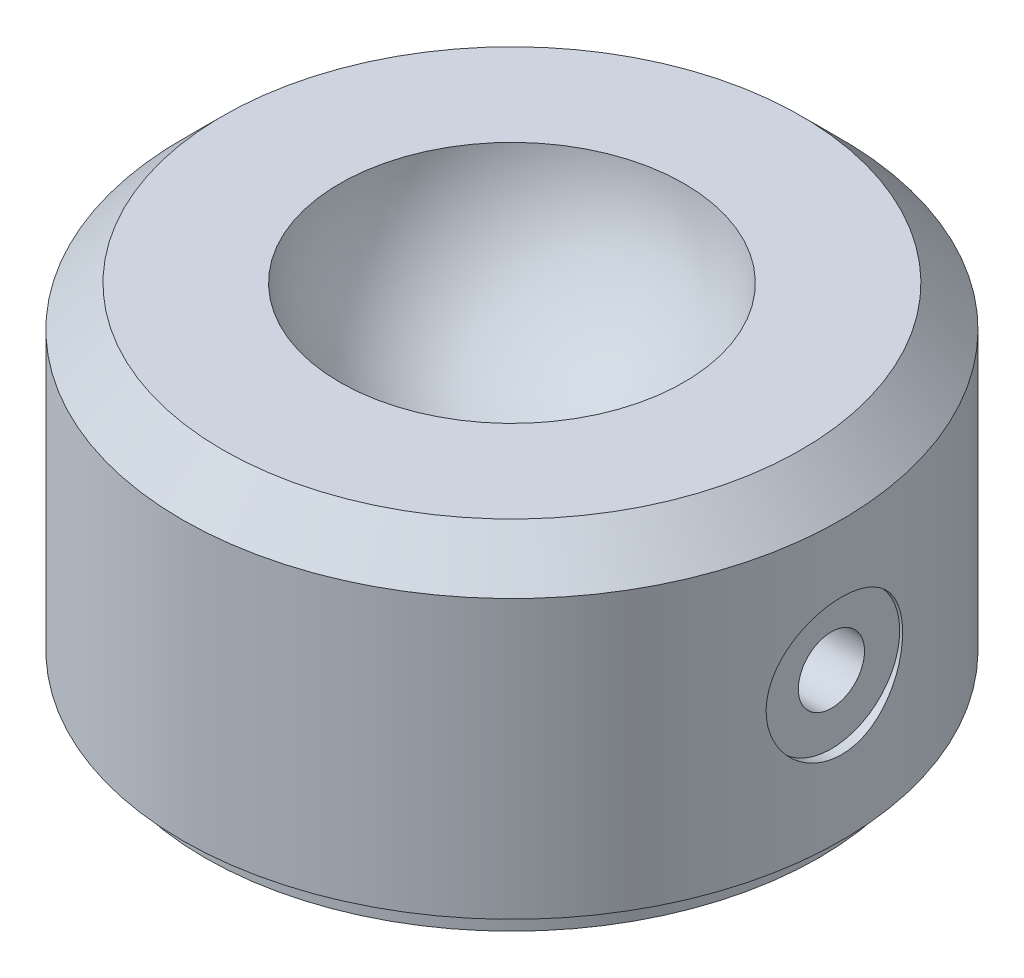
ISO-10303-21;
HEADER;
FILE_DESCRIPTION(('STEP AP214'),'2;1');
FILE_NAME('part.step','',(''),(''),'','','');
FILE_SCHEMA(('AUTOMOTIVE_DESIGN { 1 0 10303 214 1 1 1 1 }'));
ENDSEC;
DATA;
#1=APPLICATION_CONTEXT('core data for automotive mechanical design processes');
#2=APPLICATION_PROTOCOL_DEFINITION('international standard','automotive_design',2000,#1);
#3=PRODUCT_CONTEXT('',#1,'mechanical');
#4=PRODUCT('Part','Part','',(#3));
#5=PRODUCT_RELATED_PRODUCT_CATEGORY('part','',(#4));
#6=PRODUCT_DEFINITION_FORMATION('','',#4);
#7=PRODUCT_DEFINITION_CONTEXT('part definition',#1,'design');
#8=PRODUCT_DEFINITION('design','',#6,#7);
#9=PRODUCT_DEFINITION_SHAPE('','',#8);
#10=(LENGTH_UNIT() NAMED_UNIT(*) SI_UNIT(.MILLI.,.METRE.));
#11=(NAMED_UNIT(*) PLANE_ANGLE_UNIT() SI_UNIT($,.RADIAN.));
#12=(NAMED_UNIT(*) SI_UNIT($,.STERADIAN.) SOLID_ANGLE_UNIT());
#13=UNCERTAINTY_MEASURE_WITH_UNIT(LENGTH_MEASURE(1.E-05),#10,'distance_accuracy_value','');
#14=(GEOMETRIC_REPRESENTATION_CONTEXT(3) GLOBAL_UNCERTAINTY_ASSIGNED_CONTEXT((#13)) GLOBAL_UNIT_ASSIGNED_CONTEXT((#10,
#11,#12)) REPRESENTATION_CONTEXT('',''));
#15=CARTESIAN_POINT('',(0.,0.,0.));
#16=DIRECTION('',(0.,0.,1.));
#17=DIRECTION('',(1.,0.,0.));
#18=AXIS2_PLACEMENT_3D('',#15,#16,#17);
#19=CARTESIAN_POINT('',(0.,6.0071,0.));
#20=DIRECTION('',(0.,1.,0.));
#21=DIRECTION('',(0.,0.,1.));
#22=AXIS2_PLACEMENT_3D('',#19,#20,#21);
#23=PLANE('',#22);
#24=CARTESIAN_POINT('',(0.,6.0071,0.));
#25=DIRECTION('',(0.,1.,0.));
#26=DIRECTION('',(0.,0.,1.));
#27=AXIS2_PLACEMENT_3D('',#24,#25,#26);
#28=CIRCLE('',#27,10.922);
#29=CARTESIAN_POINT('',(0.,6.0071,10.922));
#30=VERTEX_POINT('',#29);
#31=EDGE_CURVE('E80',#30,#30,#28,.T.);
#32=ORIENTED_EDGE('',*,*,#31,.T.);
#33=EDGE_LOOP('',(#32));
#34=FACE_BOUND('',#33,.T.);
#35=CARTESIAN_POINT('',(0.,6.0071,0.));
#36=DIRECTION('',(0.,1.,0.));
#37=DIRECTION('',(0.,0.,1.));
#38=AXIS2_PLACEMENT_3D('',#35,#36,#37);
#39=CIRCLE('',#38,6.5001796436837);
#40=CARTESIAN_POINT('',(0.,6.0071,6.5001796436837));
#41=VERTEX_POINT('',#40);
#42=EDGE_CURVE('E68',#41,#41,#39,.F.);
#43=ORIENTED_EDGE('',*,*,#42,.T.);
#44=EDGE_LOOP('',(#43));
#45=FACE_BOUND('',#44,.T.);
#46=ADVANCED_FACE('F36',(#34,#45),#23,.T.);
#47=CARTESIAN_POINT('',(0.,-6.0071,0.));
#48=DIRECTION('',(0.,1.,0.));
#49=DIRECTION('',(0.,0.,1.));
#50=AXIS2_PLACEMENT_3D('',#47,#48,#49);
#51=PLANE('',#50);
#52=CARTESIAN_POINT('',(0.,-6.0071,0.));
#53=DIRECTION('',(0.,1.,0.));
#54=DIRECTION('',(0.,0.,1.));
#55=AXIS2_PLACEMENT_3D('',#52,#53,#54);
#56=CIRCLE('',#55,12.446);
#57=CARTESIAN_POINT('',(0.,-6.0071,12.446));
#58=VERTEX_POINT('',#57);
#59=EDGE_CURVE('E77',#58,#58,#56,.T.);
#60=ORIENTED_EDGE('',*,*,#59,.F.);
#61=EDGE_LOOP('',(#60));
#62=FACE_BOUND('',#61,.T.);
#63=CARTESIAN_POINT('',(0.,-6.0071,0.));
#64=DIRECTION('',(0.,1.,0.));
#65=DIRECTION('',(0.,0.,1.));
#66=AXIS2_PLACEMENT_3D('',#63,#64,#65);
#67=CIRCLE('',#66,11.5951);
#68=CARTESIAN_POINT('',(0.,-6.0071,11.5951));
#69=VERTEX_POINT('',#68);
#70=EDGE_CURVE('E46',#69,#69,#67,.F.);
#71=ORIENTED_EDGE('',*,*,#70,.F.);
#72=EDGE_LOOP('',(#71));
#73=FACE_BOUND('',#72,.T.);
#74=ADVANCED_FACE('F108',(#62,#73),#51,.F.);
#75=CARTESIAN_POINT('',(0.,6.0071,0.));
#76=DIRECTION('',(0.,-1.,0.));
#77=DIRECTION('',(0.,0.,-1.));
#78=AXIS2_PLACEMENT_3D('',#75,#76,#77);
#79=CYLINDRICAL_SURFACE('',#78,12.446);
#80=CARTESIAN_POINT('',(12.1760550421719,-0.6223,-2.5781));
#81=CARTESIAN_POINT('',(12.1760579161759,-0.765436207380414,-2.57809483831996));
#82=CARTESIAN_POINT('',(12.1786064693682,-0.90863629867503,-2.56613910104311));
#83=CARTESIAN_POINT('',(12.1885089559425,-1.19097753976139,-2.5186765117093));
#84=CARTESIAN_POINT('',(12.195866596214,-1.33011547190427,-2.48315149190922));
#85=CARTESIAN_POINT('',(12.2145190196045,-1.60020702824344,-2.38970579313672));
#86=CARTESIAN_POINT('',(12.2258097359615,-1.73116894205712,-2.33180824041126));
#87=CARTESIAN_POINT('',(12.2510512766012,-1.98151927823464,-2.19532539759628));
#88=CARTESIAN_POINT('',(12.2650019874416,-2.10090819383088,-2.11674098969568));
#89=CARTESIAN_POINT('',(12.2942279247945,-2.32653819900246,-1.93984513553784));
#90=CARTESIAN_POINT('',(12.3095185911322,-2.43257827909951,-1.84127981115731));
#91=CARTESIAN_POINT('',(12.3395659466728,-2.62674359629513,-1.6277683945702));
#92=CARTESIAN_POINT('',(12.3543225969028,-2.71486752802085,-1.51282110980905));
#93=CARTESIAN_POINT('',(12.3818063841349,-2.87148468652724,-1.26847137834301));
#94=CARTESIAN_POINT('',(12.3945131863925,-2.93978602786657,-1.13894345815747));
#95=CARTESIAN_POINT('',(12.4162917638457,-3.05357978129639,-0.869942235671268));
#96=CARTESIAN_POINT('',(12.4253639042794,-3.09907448528449,-0.730469934316673));
#97=CARTESIAN_POINT('',(12.4387418838477,-3.16533537918545,-0.447626676608212));
#98=CARTESIAN_POINT('',(12.4431131435972,-3.18644129718095,-0.304338453464356));
#99=CARTESIAN_POINT('',(12.4468230507835,-3.20438627251898,-0.0161927334004353));
#100=CARTESIAN_POINT('',(12.4461622169122,-3.20122783095367,0.128664600243735));
#101=CARTESIAN_POINT('',(12.4399328297405,-3.17098968951854,0.41349932886032));
#102=CARTESIAN_POINT('',(12.4344393745033,-3.14427601883043,0.553517463978391));
#103=CARTESIAN_POINT('',(12.4192469994913,-3.06826729945782,0.827039534672957));
#104=CARTESIAN_POINT('',(12.4095479029999,-3.01897130188312,0.960543196255941));
#105=CARTESIAN_POINT('',(12.3869113759362,-2.89886389025057,1.21828038659435));
#106=CARTESIAN_POINT('',(12.3739527248129,-2.82791081017113,1.3424459579488));
#107=CARTESIAN_POINT('',(12.3462228265745,-2.66660845054558,1.5772431896656));
#108=CARTESIAN_POINT('',(12.3314513566287,-2.57625678551136,1.6878731828981));
#109=CARTESIAN_POINT('',(12.3013990353313,-2.37671959456915,1.89463292896738));
#110=CARTESIAN_POINT('',(12.2861138233237,-2.26721370825951,1.99045312773948));
#111=CARTESIAN_POINT('',(12.2570173539799,-2.03353131687161,2.16242250552562));
#112=CARTESIAN_POINT('',(12.2432061287331,-1.90935449252311,2.23857125633294));
#113=CARTESIAN_POINT('',(12.2186116671616,-1.64938990506203,2.36915424036746));
#114=CARTESIAN_POINT('',(12.2078358700401,-1.51357466191361,2.42353526026166));
#115=CARTESIAN_POINT('',(12.1906390490583,-1.23445899908573,2.50861291968142));
#116=CARTESIAN_POINT('',(12.1842174124135,-1.09115963574561,2.53931289205279));
#117=CARTESIAN_POINT('',(12.1765796006449,-0.803957606580551,2.57568787674998));
#118=CARTESIAN_POINT('',(12.1752701658251,-0.660114147681981,2.58181128744164));
#119=CARTESIAN_POINT('',(12.1777542242031,-0.373461419385834,2.57006867321218));
#120=CARTESIAN_POINT('',(12.1815474055359,-0.230652087320149,2.55220411440327));
#121=CARTESIAN_POINT('',(12.1937216925506,0.0483513629252177,2.4933801744909));
#122=CARTESIAN_POINT('',(12.2020546338063,0.184598864100105,2.45266311160834));
#123=CARTESIAN_POINT('',(12.2223268439924,0.448338083949179,2.34955027905924));
#124=CARTESIAN_POINT('',(12.2342664281927,0.575829035985054,2.28715261414016));
#125=CARTESIAN_POINT('',(12.2606144342395,0.820390213673221,2.1414449082384));
#126=CARTESIAN_POINT('',(12.2750549030789,0.937290716863754,2.05785590904265));
#127=CARTESIAN_POINT('',(12.3046909578144,1.15556954868998,1.87250761317661));
#128=CARTESIAN_POINT('',(12.3198866272287,1.25694615544662,1.77074630357828));
#129=CARTESIAN_POINT('',(12.3496253597795,1.44301453809699,1.54992303714825));
#130=CARTESIAN_POINT('',(12.3641534472041,1.52740218823971,1.43060247123221));
#131=CARTESIAN_POINT('',(12.3906542194833,1.67493350358039,1.17921771282571));
#132=CARTESIAN_POINT('',(12.402627016461,1.73807810096892,1.04715407985561));
#133=CARTESIAN_POINT('',(12.4226045412503,1.84089487513778,0.774807222998114));
#134=CARTESIAN_POINT('',(12.4306327670947,1.88070632976634,0.634578380381921));
#135=CARTESIAN_POINT('',(12.4419176813876,1.93616581255276,0.349239790883253));
#136=CARTESIAN_POINT('',(12.4451749884417,1.95181697339006,0.204130679281228));
#137=CARTESIAN_POINT('',(12.4465350367286,1.95838297950394,-0.0839511458295016));
#138=CARTESIAN_POINT('',(12.4447328087927,1.94975386268994,-0.226913210670867));
#139=CARTESIAN_POINT('',(12.4363774997964,1.90901606584936,-0.509302662902665));
#140=CARTESIAN_POINT('',(12.4298244876157,1.87690772623875,-0.648730101509922));
#141=CARTESIAN_POINT('',(12.4127082238895,1.79033164868514,-0.919782733473749));
#142=CARTESIAN_POINT('',(12.4021554686694,1.73592240373113,-1.05142731458867));
#143=CARTESIAN_POINT('',(12.3781724334103,1.60634857398583,-1.30378245836165));
#144=CARTESIAN_POINT('',(12.3647419061504,1.53118220585057,-1.42449208036103));
#145=CARTESIAN_POINT('',(12.3361855985561,1.36070851278772,-1.65379460366482));
#146=CARTESIAN_POINT('',(12.3210346300185,1.2650769559567,-1.7621433452447));
#147=CARTESIAN_POINT('',(12.290889342249,1.05704928042233,-1.96141172964145));
#148=CARTESIAN_POINT('',(12.2758950611875,0.94464917415227,-2.05232721504011));
#149=CARTESIAN_POINT('',(12.2475665256637,0.704693493058984,-2.21516586524022));
#150=CARTESIAN_POINT('',(12.2342537777349,0.576975788583818,-2.28685404202271));
#151=CARTESIAN_POINT('',(12.2110610187779,0.311063433550885,-2.40763724478487));
#152=CARTESIAN_POINT('',(12.2011779725164,0.172878179259104,-2.45675226021834));
#153=CARTESIAN_POINT('',(12.1878827886588,-0.0750152366852909,-2.52174952733032));
#154=CARTESIAN_POINT('',(12.1834755854465,-0.183334047058352,-2.54284215363119));
#155=CARTESIAN_POINT('',(12.1775606625411,-0.401855989640944,-2.57101910185683));
#156=CARTESIAN_POINT('',(12.1760528286654,-0.512059047472776,-2.57810397543386));
#157=CARTESIAN_POINT('',(12.1760550421719,-0.6223,-2.5781));
#158=B_SPLINE_CURVE_WITH_KNOTS('',3,(#80,#81,#82,#83,#84,#85,#86,#87,#88,#89,#90,#91,#92,#93,
#94,#95,#96,#97,#98,#99,#100,#101,#102,#103,#104,#105,#106,#107,#108,#109,#110,#111,#112,#113,
#114,#115,#116,#117,#118,#119,#120,#121,#122,#123,#124,#125,#126,#127,#128,#129,#130,#131,#132,
#133,#134,#135,#136,#137,#138,#139,#140,#141,#142,#143,#144,#145,#146,#147,#148,#149,#150,#151,
#152,#153,#154,#155,#156,#157),.UNSPECIFIED.,.T.,.F.,(4,2,2,2,2,2,2,2,2,2,2,2,2,2,2,2,2,2,2,2,2,
2,2,2,2,2,2,2,2,2,2,2,2,2,2,2,2,2,4),(0.,0.429004840637051,0.858340752836482,1.2872340472138,
1.7161090544405,2.15081981877327,2.58556224484574,3.02438247108148,3.46315859030008,
3.89574607910363,4.32828897877823,4.75422667635459,5.18018227311349,5.6089861685691,
6.03784282524809,6.47471250536546,6.91159169443083,7.34953244858169,7.78741155615859,
8.21726423529409,8.64709064361183,9.07244319693337,9.49783294264497,9.92914297133646,
10.360500805462,10.799002443575,11.2374848367882,11.6733225025921,12.1091036519305,
12.5367547863127,12.9643997204731,13.3909300915463,13.8174971192956,14.2514021852283,
14.6854105988902,15.1245037422822,15.5632072980432,15.8936321833431,16.2240440556161),.UNSPECIFIED.);
#159=CARTESIAN_POINT('',(12.1760550421719,-0.6223,-2.5781));
#160=VERTEX_POINT('',#159);
#161=EDGE_CURVE('E11',#160,#160,#158,.T.);
#162=ORIENTED_EDGE('',*,*,#161,.T.);
#163=EDGE_LOOP('',(#162));
#164=FACE_BOUND('',#163,.T.);
#165=CARTESIAN_POINT('',(0.,4.4831,0.));
#166=DIRECTION('',(0.,1.,0.));
#167=DIRECTION('',(0.,0.,1.));
#168=AXIS2_PLACEMENT_3D('',#165,#166,#167);
#169=CIRCLE('',#168,12.446);
#170=CARTESIAN_POINT('',(0.,4.4831,12.446));
#171=VERTEX_POINT('',#170);
#172=EDGE_CURVE('E83',#171,#171,#169,.F.);
#173=ORIENTED_EDGE('',*,*,#172,.T.);
#174=EDGE_LOOP('',(#173));
#175=FACE_BOUND('',#174,.T.);
#176=ORIENTED_EDGE('',*,*,#59,.T.);
#177=EDGE_LOOP('',(#176));
#178=FACE_BOUND('',#177,.T.);
#179=ADVANCED_FACE('F114',(#164,#175,#178),#79,.T.);
#180=CARTESIAN_POINT('',(0.,6.0071,0.));
#181=DIRECTION('',(0.,-1.,0.));
#182=DIRECTION('',(0.,0.,-1.));
#183=AXIS2_PLACEMENT_3D('',#180,#181,#182);
#184=CONICAL_SURFACE('',#183,10.922,0.785398163397448);
#185=ORIENTED_EDGE('',*,*,#172,.F.);
#186=EDGE_LOOP('',(#185));
#187=FACE_BOUND('',#186,.T.);
#188=ORIENTED_EDGE('',*,*,#31,.F.);
#189=EDGE_LOOP('',(#188));
#190=FACE_BOUND('',#189,.T.);
#191=ADVANCED_FACE('F38',(#187,#190),#184,.T.);
#192=CARTESIAN_POINT('',(0.,-6.99786,0.));
#193=DIRECTION('',(0.,1.,0.));
#194=DIRECTION('',(0.,0.,1.));
#195=AXIS2_PLACEMENT_3D('',#192,#193,#194);
#196=CYLINDRICAL_SURFACE('',#195,11.5951);
#197=CARTESIAN_POINT('',(0.,-6.99786,0.));
#198=DIRECTION('',(0.,-1.,0.));
#199=DIRECTION('',(0.,0.,-1.));
#200=AXIS2_PLACEMENT_3D('',#197,#198,#199);
#201=CIRCLE('',#200,11.5951);
#202=CARTESIAN_POINT('',(0.,-6.99786,-11.5951));
#203=VERTEX_POINT('',#202);
#204=EDGE_CURVE('E74',#203,#203,#201,.T.);
#205=ORIENTED_EDGE('',*,*,#204,.F.);
#206=EDGE_LOOP('',(#205));
#207=FACE_BOUND('',#206,.T.);
#208=ORIENTED_EDGE('',*,*,#70,.T.);
#209=EDGE_LOOP('',(#208));
#210=FACE_BOUND('',#209,.T.);
#211=ADVANCED_FACE('F119',(#207,#210),#196,.T.);
#212=CARTESIAN_POINT('',(0.,-6.99786,0.));
#213=DIRECTION('',(0.,-1.,0.));
#214=DIRECTION('',(0.,0.,-1.));
#215=AXIS2_PLACEMENT_3D('',#212,#213,#214);
#216=PLANE('',#215);
#217=ORIENTED_EDGE('',*,*,#204,.T.);
#218=EDGE_LOOP('',(#217));
#219=FACE_BOUND('',#218,.T.);
#220=ADVANCED_FACE('F136',(#219),#216,.T.);
#221=CARTESIAN_POINT('',(0.,6.5151,0.));
#222=DIRECTION('',(0.,1.,0.));
#223=DIRECTION('',(1.,0.,0.));
#224=AXIS2_PLACEMENT_3D('',#221,#222,#223);
#225=SPHERICAL_SURFACE('',#224,6.519999954);
#226=ORIENTED_EDGE('',*,*,#42,.F.);
#227=EDGE_LOOP('',(#226));
#228=FACE_BOUND('',#227,.T.);
#229=CARTESIAN_POINT('',(0.,0.191316073413008,0.));
#230=DIRECTION('',(0.,1.,0.));
#231=DIRECTION('',(0.,0.,1.));
#232=AXIS2_PLACEMENT_3D('',#229,#230,#231);
#233=CIRCLE('',#232,1.5875);
#234=CARTESIAN_POINT('',(0.,0.191316073413008,1.5875));
#235=VERTEX_POINT('',#234);
#236=EDGE_CURVE('E63',#235,#235,#233,.F.);
#237=ORIENTED_EDGE('',*,*,#236,.T.);
#238=EDGE_LOOP('',(#237));
#239=FACE_BOUND('',#238,.T.);
#240=ADVANCED_FACE('F90',(#228,#239),#225,.F.);
#241=CARTESIAN_POINT('',(0.,-0.3683,0.));
#242=DIRECTION('',(0.,1.,0.));
#243=DIRECTION('',(0.,0.,1.));
#244=AXIS2_PLACEMENT_3D('',#241,#242,#243);
#245=PLANE('',#244);
#246=CARTESIAN_POINT('',(0.,-0.3683,0.));
#247=DIRECTION('',(0.,1.,0.));
#248=DIRECTION('',(0.,0.,1.));
#249=AXIS2_PLACEMENT_3D('',#246,#247,#248);
#250=CIRCLE('',#249,1.5875);
#251=CARTESIAN_POINT('',(0.,-0.3683,1.5875));
#252=VERTEX_POINT('',#251);
#253=EDGE_CURVE('E71',#252,#252,#250,.T.);
#254=ORIENTED_EDGE('',*,*,#253,.T.);
#255=EDGE_LOOP('',(#254));
#256=FACE_BOUND('',#255,.T.);
#257=ADVANCED_FACE('F95',(#256),#245,.T.);
#258=CARTESIAN_POINT('',(0.,-0.3683,0.));
#259=DIRECTION('',(0.,1.,0.));
#260=DIRECTION('',(0.,0.,1.));
#261=AXIS2_PLACEMENT_3D('',#258,#259,#260);
#262=CYLINDRICAL_SURFACE('',#261,1.5875);
#263=ORIENTED_EDGE('',*,*,#253,.F.);
#264=EDGE_LOOP('',(#263));
#265=FACE_BOUND('',#264,.T.);
#266=ORIENTED_EDGE('',*,*,#236,.F.);
#267=EDGE_LOOP('',(#266));
#268=FACE_BOUND('',#267,.T.);
#269=ADVANCED_FACE('F92',(#265,#268),#262,.F.);
#270=CARTESIAN_POINT('',(12.446,-0.6223,0.));
#271=DIRECTION('',(1.,0.,0.));
#272=DIRECTION('',(0.,0.,-1.));
#273=AXIS2_PLACEMENT_3D('',#270,#271,#272);
#274=CYLINDRICAL_SURFACE('',#273,2.5781);
#275=CARTESIAN_POINT('',(12.065,-0.6223,0.));
#276=DIRECTION('',(1.,0.,0.));
#277=DIRECTION('',(0.,0.,-1.));
#278=AXIS2_PLACEMENT_3D('',#275,#276,#277);
#279=CIRCLE('',#278,2.5781);
#280=CARTESIAN_POINT('',(12.065,-0.6223,-2.5781));
#281=VERTEX_POINT('',#280);
#282=EDGE_CURVE('E59',#281,#281,#279,.T.);
#283=ORIENTED_EDGE('',*,*,#282,.F.);
#284=EDGE_LOOP('',(#283));
#285=FACE_BOUND('',#284,.T.);
#286=ORIENTED_EDGE('',*,*,#161,.F.);
#287=EDGE_LOOP('',(#286));
#288=FACE_BOUND('',#287,.T.);
#289=ADVANCED_FACE('F94',(#285,#288),#274,.F.);
#290=CARTESIAN_POINT('',(12.065,-0.6223,0.));
#291=DIRECTION('',(-1.,0.,0.));
#292=DIRECTION('',(0.,0.,1.));
#293=AXIS2_PLACEMENT_3D('',#290,#291,#292);
#294=PLANE('',#293);
#295=CARTESIAN_POINT('',(12.065,-0.6223,0.));
#296=DIRECTION('',(1.,0.,0.));
#297=DIRECTION('',(0.,0.,-1.));
#298=AXIS2_PLACEMENT_3D('',#295,#296,#297);
#299=CIRCLE('',#298,1.24999999999999);
#300=CARTESIAN_POINT('',(12.065,-0.6223,-1.24999999999999));
#301=VERTEX_POINT('',#300);
#302=EDGE_CURVE('E60',#301,#301,#299,.T.);
#303=ORIENTED_EDGE('',*,*,#302,.F.);
#304=EDGE_LOOP('',(#303));
#305=FACE_BOUND('',#304,.T.);
#306=ORIENTED_EDGE('',*,*,#282,.T.);
#307=EDGE_LOOP('',(#306));
#308=FACE_BOUND('',#307,.T.);
#309=ADVANCED_FACE('F53',(#305,#308),#294,.F.);
#310=CARTESIAN_POINT('',(6.7564,-0.6223,0.));
#311=DIRECTION('',(1.,0.,0.));
#312=DIRECTION('',(0.,0.,-1.));
#313=AXIS2_PLACEMENT_3D('',#310,#311,#312);
#314=CONICAL_SURFACE('',#313,1.25,1.02974425867665);
#315=CARTESIAN_POINT('',(6.00532422621555,-0.622300000000001,0.));
#316=VERTEX_POINT('',#315);
#317=VERTEX_LOOP('',#316);
#318=FACE_BOUND('',#317,.T.);
#319=CARTESIAN_POINT('',(6.7564,-0.6223,0.));
#320=DIRECTION('',(1.,0.,0.));
#321=DIRECTION('',(0.,0.,-1.));
#322=AXIS2_PLACEMENT_3D('',#319,#320,#321);
#323=CIRCLE('',#322,1.25);
#324=CARTESIAN_POINT('',(6.7564,-0.6223,-1.25));
#325=VERTEX_POINT('',#324);
#326=EDGE_CURVE('E57',#325,#325,#323,.T.);
#327=ORIENTED_EDGE('',*,*,#326,.T.);
#328=EDGE_LOOP('',(#327));
#329=FACE_BOUND('',#328,.T.);
#330=ADVANCED_FACE('F49',(#318,#329),#314,.F.);
#331=CARTESIAN_POINT('',(12.065,-0.6223,0.));
#332=DIRECTION('',(1.,0.,0.));
#333=DIRECTION('',(0.,0.,-1.));
#334=AXIS2_PLACEMENT_3D('',#331,#332,#333);
#335=CYLINDRICAL_SURFACE('',#334,1.25);
#336=ORIENTED_EDGE('',*,*,#326,.F.);
#337=EDGE_LOOP('',(#336));
#338=FACE_BOUND('',#337,.T.);
#339=ORIENTED_EDGE('',*,*,#302,.T.);
#340=EDGE_LOOP('',(#339));
#341=FACE_BOUND('',#340,.T.);
#342=ADVANCED_FACE('F52',(#338,#341),#335,.F.);
#343=CLOSED_SHELL('',(#46,#74,#179,#191,#211,#220,#240,#257,#269,#289,#309,#330,#342));
#344=MANIFOLD_SOLID_BREP('B2',#343);
#345=ADVANCED_BREP_SHAPE_REPRESENTATION('',(#18,#344),#14);
#346=SHAPE_DEFINITION_REPRESENTATION(#9,#345);
ENDSEC;
END-ISO-10303-21;
